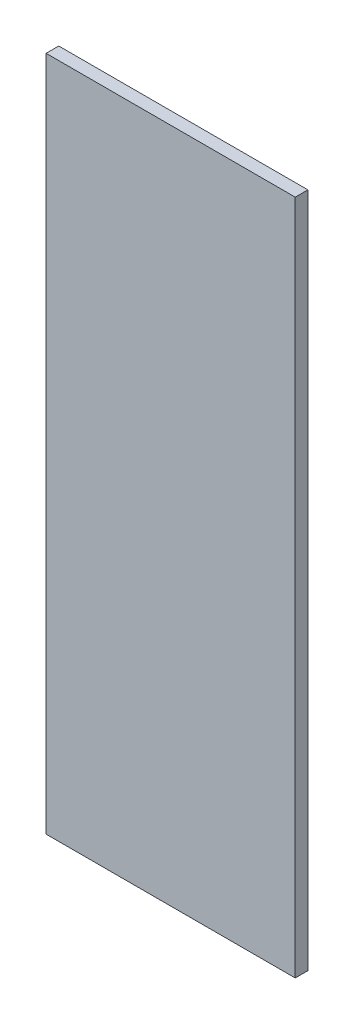
ISO-10303-21;
HEADER;
FILE_DESCRIPTION(('STEP AP214'),'2;1');
FILE_NAME('part.step','',(''),(''),'','','');
FILE_SCHEMA(('AUTOMOTIVE_DESIGN { 1 0 10303 214 1 1 1 1 }'));
ENDSEC;
DATA;
#1=APPLICATION_CONTEXT('core data for automotive mechanical design processes');
#2=APPLICATION_PROTOCOL_DEFINITION('international standard','automotive_design',2000,#1);
#3=PRODUCT_CONTEXT('',#1,'mechanical');
#4=PRODUCT('Part','Part','',(#3));
#5=PRODUCT_RELATED_PRODUCT_CATEGORY('part','',(#4));
#6=PRODUCT_DEFINITION_FORMATION('','',#4);
#7=PRODUCT_DEFINITION_CONTEXT('part definition',#1,'design');
#8=PRODUCT_DEFINITION('design','',#6,#7);
#9=PRODUCT_DEFINITION_SHAPE('','',#8);
#10=(LENGTH_UNIT() NAMED_UNIT(*) SI_UNIT(.MILLI.,.METRE.));
#11=(NAMED_UNIT(*) PLANE_ANGLE_UNIT() SI_UNIT($,.RADIAN.));
#12=(NAMED_UNIT(*) SI_UNIT($,.STERADIAN.) SOLID_ANGLE_UNIT());
#13=UNCERTAINTY_MEASURE_WITH_UNIT(LENGTH_MEASURE(1.E-05),#10,'distance_accuracy_value','');
#14=(GEOMETRIC_REPRESENTATION_CONTEXT(3) GLOBAL_UNCERTAINTY_ASSIGNED_CONTEXT((#13)) GLOBAL_UNIT_ASSIGNED_CONTEXT((#10,
#11,#12)) REPRESENTATION_CONTEXT('',''));
#15=CARTESIAN_POINT('',(0.,0.,0.));
#16=DIRECTION('',(0.,0.,1.));
#17=DIRECTION('',(1.,0.,0.));
#18=AXIS2_PLACEMENT_3D('',#15,#16,#17);
#19=CARTESIAN_POINT('',(86.6920013427734,76.5279998779297,0.));
#20=DIRECTION('',(1.,0.,0.));
#21=DIRECTION('',(0.,-1.,0.));
#22=AXIS2_PLACEMENT_3D('',#19,#20,#21);
#23=PLANE('',#22);
#24=DIRECTION('',(0.,-1.,0.));
#25=VECTOR('',#24,1.);
#26=CARTESIAN_POINT('',(86.6920013427734,76.5279998779297,0.03556));
#27=LINE('',#26,#25);
#28=CARTESIAN_POINT('',(86.6920013427734,76.5279998779297,0.03556));
#29=VERTEX_POINT('',#28);
#30=CARTESIAN_POINT('',(86.6920013427734,74.6279983520508,0.03556));
#31=VERTEX_POINT('',#30);
#32=EDGE_CURVE('E11',#29,#31,#27,.T.);
#33=ORIENTED_EDGE('',*,*,#32,.F.);
#34=DIRECTION('',(0.,0.,1.));
#35=VECTOR('',#34,1.);
#36=CARTESIAN_POINT('',(86.6920013427734,76.5279998779297,0.));
#37=LINE('',#36,#35);
#38=CARTESIAN_POINT('',(86.6920013427734,76.5279998779297,0.));
#39=VERTEX_POINT('',#38);
#40=EDGE_CURVE('E24',#39,#29,#37,.T.);
#41=ORIENTED_EDGE('',*,*,#40,.F.);
#42=DIRECTION('',(0.,-1.,0.));
#43=VECTOR('',#42,1.);
#44=CARTESIAN_POINT('',(86.6920013427734,76.5279998779297,0.));
#45=LINE('',#44,#43);
#46=CARTESIAN_POINT('',(86.6920013427734,74.6279983520508,0.));
#47=VERTEX_POINT('',#46);
#48=EDGE_CURVE('E75',#39,#47,#45,.T.);
#49=ORIENTED_EDGE('',*,*,#48,.T.);
#50=DIRECTION('',(0.,0.,1.));
#51=VECTOR('',#50,1.);
#52=CARTESIAN_POINT('',(86.6920013427734,74.6279983520508,0.));
#53=LINE('',#52,#51);
#54=EDGE_CURVE('E37',#47,#31,#53,.T.);
#55=ORIENTED_EDGE('',*,*,#54,.T.);
#56=EDGE_LOOP('',(#33,#41,#49,#55));
#57=FACE_BOUND('',#56,.T.);
#58=ADVANCED_FACE('F17',(#57),#23,.F.);
#59=CARTESIAN_POINT('',(86.6920013427734,74.6279983520508,0.));
#60=DIRECTION('',(0.,1.,0.));
#61=DIRECTION('',(1.,0.,0.));
#62=AXIS2_PLACEMENT_3D('',#59,#60,#61);
#63=PLANE('',#62);
#64=DIRECTION('',(1.,0.,0.));
#65=VECTOR('',#64,1.);
#66=CARTESIAN_POINT('',(86.6920013427734,74.6279983520508,0.03556));
#67=LINE('',#66,#65);
#68=CARTESIAN_POINT('',(87.3919982910156,74.6279983520508,0.03556));
#69=VERTEX_POINT('',#68);
#70=EDGE_CURVE('E83',#31,#69,#67,.T.);
#71=ORIENTED_EDGE('',*,*,#70,.F.);
#72=ORIENTED_EDGE('',*,*,#54,.F.);
#73=DIRECTION('',(1.,0.,0.));
#74=VECTOR('',#73,1.);
#75=CARTESIAN_POINT('',(86.6920013427734,74.6279983520508,0.));
#76=LINE('',#75,#74);
#77=CARTESIAN_POINT('',(87.3919982910156,74.6279983520508,0.));
#78=VERTEX_POINT('',#77);
#79=EDGE_CURVE('E81',#47,#78,#76,.T.);
#80=ORIENTED_EDGE('',*,*,#79,.T.);
#81=DIRECTION('',(0.,0.,1.));
#82=VECTOR('',#81,1.);
#83=CARTESIAN_POINT('',(87.3919982910156,74.6279983520508,0.));
#84=LINE('',#83,#82);
#85=EDGE_CURVE('E67',#78,#69,#84,.T.);
#86=ORIENTED_EDGE('',*,*,#85,.T.);
#87=EDGE_LOOP('',(#71,#72,#80,#86));
#88=FACE_BOUND('',#87,.T.);
#89=ADVANCED_FACE('F89',(#88),#63,.F.);
#90=CARTESIAN_POINT('',(87.3919982910156,74.6279983520508,0.));
#91=DIRECTION('',(-1.,0.,0.));
#92=DIRECTION('',(0.,1.,0.));
#93=AXIS2_PLACEMENT_3D('',#90,#91,#92);
#94=PLANE('',#93);
#95=DIRECTION('',(0.,1.,0.));
#96=VECTOR('',#95,1.);
#97=CARTESIAN_POINT('',(87.3919982910156,74.6279983520508,0.03556));
#98=LINE('',#97,#96);
#99=CARTESIAN_POINT('',(87.3919982910156,76.5279998779297,0.03556));
#100=VERTEX_POINT('',#99);
#101=EDGE_CURVE('E71',#69,#100,#98,.T.);
#102=ORIENTED_EDGE('',*,*,#101,.F.);
#103=ORIENTED_EDGE('',*,*,#85,.F.);
#104=DIRECTION('',(0.,1.,0.));
#105=VECTOR('',#104,1.);
#106=CARTESIAN_POINT('',(87.3919982910156,74.6279983520508,0.));
#107=LINE('',#106,#105);
#108=CARTESIAN_POINT('',(87.3919982910156,76.5279998779297,0.));
#109=VERTEX_POINT('',#108);
#110=EDGE_CURVE('E63',#78,#109,#107,.T.);
#111=ORIENTED_EDGE('',*,*,#110,.T.);
#112=DIRECTION('',(0.,0.,1.));
#113=VECTOR('',#112,1.);
#114=CARTESIAN_POINT('',(87.3919982910156,76.5279998779297,0.));
#115=LINE('',#114,#113);
#116=EDGE_CURVE('E53',#109,#100,#115,.T.);
#117=ORIENTED_EDGE('',*,*,#116,.T.);
#118=EDGE_LOOP('',(#102,#103,#111,#117));
#119=FACE_BOUND('',#118,.T.);
#120=ADVANCED_FACE('F66',(#119),#94,.F.);
#121=CARTESIAN_POINT('',(87.3919982910156,76.5279998779297,0.));
#122=DIRECTION('',(0.,-1.,0.));
#123=DIRECTION('',(-1.,0.,0.));
#124=AXIS2_PLACEMENT_3D('',#121,#122,#123);
#125=PLANE('',#124);
#126=DIRECTION('',(-1.,0.,0.));
#127=VECTOR('',#126,1.);
#128=CARTESIAN_POINT('',(87.3919982910156,76.5279998779297,0.03556));
#129=LINE('',#128,#127);
#130=EDGE_CURVE('E59',#100,#29,#129,.T.);
#131=ORIENTED_EDGE('',*,*,#130,.F.);
#132=ORIENTED_EDGE('',*,*,#116,.F.);
#133=DIRECTION('',(-1.,0.,0.));
#134=VECTOR('',#133,1.);
#135=CARTESIAN_POINT('',(87.3919982910156,76.5279998779297,0.));
#136=LINE('',#135,#134);
#137=EDGE_CURVE('E57',#109,#39,#136,.T.);
#138=ORIENTED_EDGE('',*,*,#137,.T.);
#139=ORIENTED_EDGE('',*,*,#40,.T.);
#140=EDGE_LOOP('',(#131,#132,#138,#139));
#141=FACE_BOUND('',#140,.T.);
#142=ADVANCED_FACE('F55',(#141),#125,.F.);
#143=CARTESIAN_POINT('',(86.6920013427734,76.5279998779297,0.));
#144=DIRECTION('',(0.,0.,-1.));
#145=DIRECTION('',(-1.,0.,0.));
#146=AXIS2_PLACEMENT_3D('',#143,#144,#145);
#147=PLANE('',#146);
#148=ORIENTED_EDGE('',*,*,#137,.F.);
#149=ORIENTED_EDGE('',*,*,#110,.F.);
#150=ORIENTED_EDGE('',*,*,#79,.F.);
#151=ORIENTED_EDGE('',*,*,#48,.F.);
#152=EDGE_LOOP('',(#148,#149,#150,#151));
#153=FACE_BOUND('',#152,.T.);
#154=ADVANCED_FACE('F74',(#153),#147,.T.);
#155=CARTESIAN_POINT('',(86.6920013427734,76.5279998779297,0.03556));
#156=DIRECTION('',(0.,0.,-1.));
#157=DIRECTION('',(-1.,0.,0.));
#158=AXIS2_PLACEMENT_3D('',#155,#156,#157);
#159=PLANE('',#158);
#160=ORIENTED_EDGE('',*,*,#32,.T.);
#161=ORIENTED_EDGE('',*,*,#70,.T.);
#162=ORIENTED_EDGE('',*,*,#101,.T.);
#163=ORIENTED_EDGE('',*,*,#130,.T.);
#164=EDGE_LOOP('',(#160,#161,#162,#163));
#165=FACE_BOUND('',#164,.T.);
#166=ADVANCED_FACE('F91',(#165),#159,.F.);
#167=CLOSED_SHELL('',(#58,#89,#120,#142,#154,#166));
#168=MANIFOLD_SOLID_BREP('B1',#167);
#169=ADVANCED_BREP_SHAPE_REPRESENTATION('',(#18,#168),#14);
#170=SHAPE_DEFINITION_REPRESENTATION(#9,#169);
ENDSEC;
END-ISO-10303-21;
